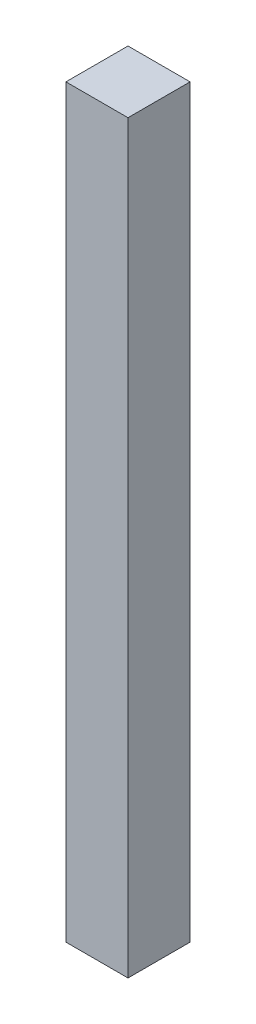
ISO-10303-21;
HEADER;
FILE_DESCRIPTION(('STEP AP214'),'2;1');
FILE_NAME('part.step','',(''),(''),'','','');
FILE_SCHEMA(('AUTOMOTIVE_DESIGN { 1 0 10303 214 1 1 1 1 }'));
ENDSEC;
DATA;
#1=APPLICATION_CONTEXT('core data for automotive mechanical design processes');
#2=APPLICATION_PROTOCOL_DEFINITION('international standard','automotive_design',2000,#1);
#3=PRODUCT_CONTEXT('',#1,'mechanical');
#4=PRODUCT('Part','Part','',(#3));
#5=PRODUCT_RELATED_PRODUCT_CATEGORY('part','',(#4));
#6=PRODUCT_DEFINITION_FORMATION('','',#4);
#7=PRODUCT_DEFINITION_CONTEXT('part definition',#1,'design');
#8=PRODUCT_DEFINITION('design','',#6,#7);
#9=PRODUCT_DEFINITION_SHAPE('','',#8);
#10=(LENGTH_UNIT() NAMED_UNIT(*) SI_UNIT(.MILLI.,.METRE.));
#11=(NAMED_UNIT(*) PLANE_ANGLE_UNIT() SI_UNIT($,.RADIAN.));
#12=(NAMED_UNIT(*) SI_UNIT($,.STERADIAN.) SOLID_ANGLE_UNIT());
#13=UNCERTAINTY_MEASURE_WITH_UNIT(LENGTH_MEASURE(1.E-05),#10,'distance_accuracy_value','');
#14=(GEOMETRIC_REPRESENTATION_CONTEXT(3) GLOBAL_UNCERTAINTY_ASSIGNED_CONTEXT((#13)) GLOBAL_UNIT_ASSIGNED_CONTEXT((#10,
#11,#12)) REPRESENTATION_CONTEXT('',''));
#15=CARTESIAN_POINT('',(0.,0.,0.));
#16=DIRECTION('',(0.,0.,1.));
#17=DIRECTION('',(1.,0.,0.));
#18=AXIS2_PLACEMENT_3D('',#15,#16,#17);
#19=CARTESIAN_POINT('',(12.7,-152.4,25.4));
#20=DIRECTION('',(-1.,0.,0.));
#21=DIRECTION('',(0.,0.,1.));
#22=AXIS2_PLACEMENT_3D('',#19,#20,#21);
#23=PLANE('',#22);
#24=DIRECTION('',(0.,1.,0.));
#25=VECTOR('',#24,1.);
#26=CARTESIAN_POINT('',(12.7,-152.4,0.));
#27=LINE('',#26,#25);
#28=CARTESIAN_POINT('',(12.7,-152.4,0.));
#29=VERTEX_POINT('',#28);
#30=CARTESIAN_POINT('',(12.7,152.4,0.));
#31=VERTEX_POINT('',#30);
#32=EDGE_CURVE('E96',#29,#31,#27,.T.);
#33=ORIENTED_EDGE('',*,*,#32,.T.);
#34=DIRECTION('',(0.,0.,-1.));
#35=VECTOR('',#34,1.);
#36=CARTESIAN_POINT('',(12.7,152.4,25.4));
#37=LINE('',#36,#35);
#38=CARTESIAN_POINT('',(12.7,152.4,25.4));
#39=VERTEX_POINT('',#38);
#40=EDGE_CURVE('E11',#39,#31,#37,.T.);
#41=ORIENTED_EDGE('',*,*,#40,.F.);
#42=DIRECTION('',(0.,1.,0.));
#43=VECTOR('',#42,1.);
#44=CARTESIAN_POINT('',(12.7,-152.4,25.4));
#45=LINE('',#44,#43);
#46=CARTESIAN_POINT('',(12.7,-152.4,25.4));
#47=VERTEX_POINT('',#46);
#48=EDGE_CURVE('E84',#47,#39,#45,.T.);
#49=ORIENTED_EDGE('',*,*,#48,.F.);
#50=DIRECTION('',(0.,0.,-1.));
#51=VECTOR('',#50,1.);
#52=CARTESIAN_POINT('',(12.7,-152.4,25.4));
#53=LINE('',#52,#51);
#54=EDGE_CURVE('E92',#47,#29,#53,.T.);
#55=ORIENTED_EDGE('',*,*,#54,.T.);
#56=EDGE_LOOP('',(#33,#41,#49,#55));
#57=FACE_BOUND('',#56,.T.);
#58=ADVANCED_FACE('F33',(#57),#23,.F.);
#59=CARTESIAN_POINT('',(-12.7,152.4,25.4));
#60=DIRECTION('',(0.,-1.,0.));
#61=DIRECTION('',(0.,0.,-1.));
#62=AXIS2_PLACEMENT_3D('',#59,#60,#61);
#63=PLANE('',#62);
#64=DIRECTION('',(-1.,0.,0.));
#65=VECTOR('',#64,1.);
#66=CARTESIAN_POINT('',(-12.7,152.4,0.));
#67=LINE('',#66,#65);
#68=CARTESIAN_POINT('',(-12.7,152.4,0.));
#69=VERTEX_POINT('',#68);
#70=EDGE_CURVE('E88',#31,#69,#67,.T.);
#71=ORIENTED_EDGE('',*,*,#70,.T.);
#72=DIRECTION('',(0.,0.,-1.));
#73=VECTOR('',#72,1.);
#74=CARTESIAN_POINT('',(-12.7,152.4,25.4));
#75=LINE('',#74,#73);
#76=CARTESIAN_POINT('',(-12.7,152.4,25.4));
#77=VERTEX_POINT('',#76);
#78=EDGE_CURVE('E41',#77,#69,#75,.T.);
#79=ORIENTED_EDGE('',*,*,#78,.F.);
#80=DIRECTION('',(-1.,0.,0.));
#81=VECTOR('',#80,1.);
#82=CARTESIAN_POINT('',(-12.7,152.4,25.4));
#83=LINE('',#82,#81);
#84=EDGE_CURVE('E79',#39,#77,#83,.T.);
#85=ORIENTED_EDGE('',*,*,#84,.F.);
#86=ORIENTED_EDGE('',*,*,#40,.T.);
#87=EDGE_LOOP('',(#71,#79,#85,#86));
#88=FACE_BOUND('',#87,.T.);
#89=ADVANCED_FACE('F87',(#88),#63,.F.);
#90=CARTESIAN_POINT('',(-12.7,-152.4,25.4));
#91=DIRECTION('',(1.,0.,0.));
#92=DIRECTION('',(0.,0.,-1.));
#93=AXIS2_PLACEMENT_3D('',#90,#91,#92);
#94=PLANE('',#93);
#95=DIRECTION('',(0.,-1.,0.));
#96=VECTOR('',#95,1.);
#97=CARTESIAN_POINT('',(-12.7,-152.4,0.));
#98=LINE('',#97,#96);
#99=CARTESIAN_POINT('',(-12.7,-152.4,0.));
#100=VERTEX_POINT('',#99);
#101=EDGE_CURVE('E66',#69,#100,#98,.T.);
#102=ORIENTED_EDGE('',*,*,#101,.T.);
#103=DIRECTION('',(0.,0.,-1.));
#104=VECTOR('',#103,1.);
#105=CARTESIAN_POINT('',(-12.7,-152.4,25.4));
#106=LINE('',#105,#104);
#107=CARTESIAN_POINT('',(-12.7,-152.4,25.4));
#108=VERTEX_POINT('',#107);
#109=EDGE_CURVE('E89',#108,#100,#106,.T.);
#110=ORIENTED_EDGE('',*,*,#109,.F.);
#111=DIRECTION('',(0.,-1.,0.));
#112=VECTOR('',#111,1.);
#113=CARTESIAN_POINT('',(-12.7,-152.4,25.4));
#114=LINE('',#113,#112);
#115=EDGE_CURVE('E82',#77,#108,#114,.T.);
#116=ORIENTED_EDGE('',*,*,#115,.F.);
#117=ORIENTED_EDGE('',*,*,#78,.T.);
#118=EDGE_LOOP('',(#102,#110,#116,#117));
#119=FACE_BOUND('',#118,.T.);
#120=ADVANCED_FACE('F90',(#119),#94,.F.);
#121=CARTESIAN_POINT('',(-12.7,-152.4,25.4));
#122=DIRECTION('',(0.,1.,0.));
#123=DIRECTION('',(0.,0.,1.));
#124=AXIS2_PLACEMENT_3D('',#121,#122,#123);
#125=PLANE('',#124);
#126=DIRECTION('',(1.,0.,0.));
#127=VECTOR('',#126,1.);
#128=CARTESIAN_POINT('',(-12.7,-152.4,0.));
#129=LINE('',#128,#127);
#130=EDGE_CURVE('E72',#100,#29,#129,.T.);
#131=ORIENTED_EDGE('',*,*,#130,.T.);
#132=ORIENTED_EDGE('',*,*,#54,.F.);
#133=DIRECTION('',(1.,0.,0.));
#134=VECTOR('',#133,1.);
#135=CARTESIAN_POINT('',(-12.7,-152.4,25.4));
#136=LINE('',#135,#134);
#137=EDGE_CURVE('E49',#108,#47,#136,.T.);
#138=ORIENTED_EDGE('',*,*,#137,.F.);
#139=ORIENTED_EDGE('',*,*,#109,.T.);
#140=EDGE_LOOP('',(#131,#132,#138,#139));
#141=FACE_BOUND('',#140,.T.);
#142=ADVANCED_FACE('F103',(#141),#125,.F.);
#143=CARTESIAN_POINT('',(0.,0.,25.4));
#144=DIRECTION('',(0.,0.,-1.));
#145=DIRECTION('',(-1.,0.,0.));
#146=AXIS2_PLACEMENT_3D('',#143,#144,#145);
#147=PLANE('',#146);
#148=ORIENTED_EDGE('',*,*,#48,.T.);
#149=ORIENTED_EDGE('',*,*,#84,.T.);
#150=ORIENTED_EDGE('',*,*,#115,.T.);
#151=ORIENTED_EDGE('',*,*,#137,.T.);
#152=EDGE_LOOP('',(#148,#149,#150,#151));
#153=FACE_BOUND('',#152,.T.);
#154=ADVANCED_FACE('F80',(#153),#147,.F.);
#155=CARTESIAN_POINT('',(0.,0.,0.));
#156=DIRECTION('',(0.,0.,-1.));
#157=DIRECTION('',(-1.,0.,0.));
#158=AXIS2_PLACEMENT_3D('',#155,#156,#157);
#159=PLANE('',#158);
#160=ORIENTED_EDGE('',*,*,#32,.F.);
#161=ORIENTED_EDGE('',*,*,#130,.F.);
#162=ORIENTED_EDGE('',*,*,#101,.F.);
#163=ORIENTED_EDGE('',*,*,#70,.F.);
#164=EDGE_LOOP('',(#160,#161,#162,#163));
#165=FACE_BOUND('',#164,.T.);
#166=ADVANCED_FACE('F106',(#165),#159,.T.);
#167=CLOSED_SHELL('',(#58,#89,#120,#142,#154,#166));
#168=MANIFOLD_SOLID_BREP('B2',#167);
#169=ADVANCED_BREP_SHAPE_REPRESENTATION('',(#18,#168),#14);
#170=SHAPE_DEFINITION_REPRESENTATION(#9,#169);
ENDSEC;
END-ISO-10303-21;
